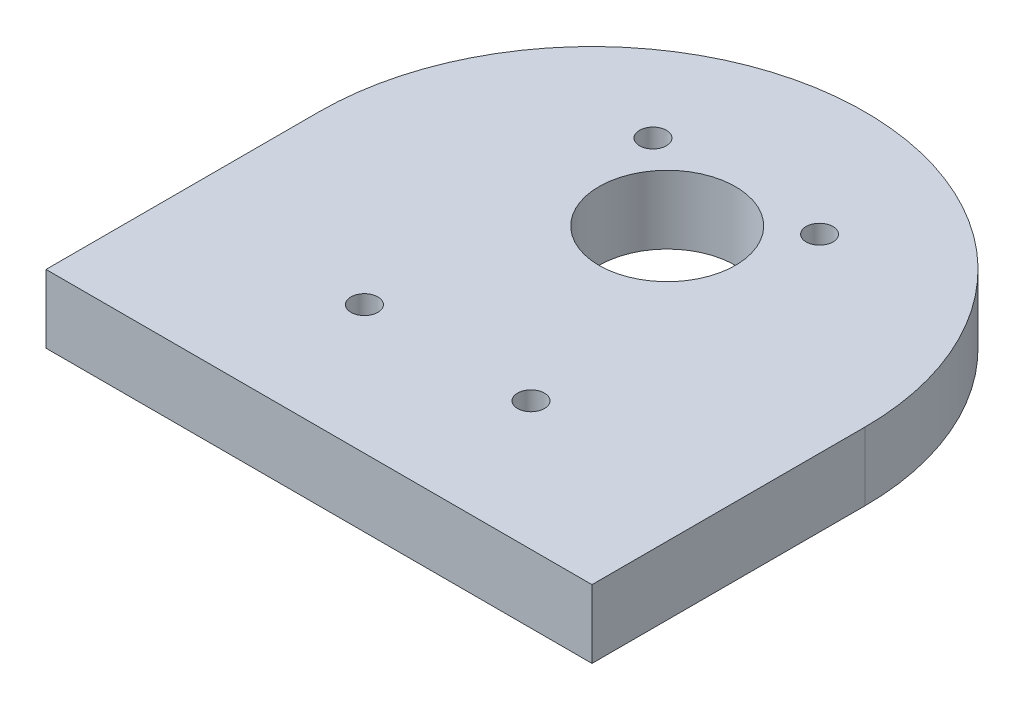
ISO-10303-21;
HEADER;
FILE_DESCRIPTION(('STEP AP214'),'2;1');
FILE_NAME('part.step','',(''),(''),'','','');
FILE_SCHEMA(('AUTOMOTIVE_DESIGN { 1 0 10303 214 1 1 1 1 }'));
ENDSEC;
DATA;
#1=APPLICATION_CONTEXT('core data for automotive mechanical design processes');
#2=APPLICATION_PROTOCOL_DEFINITION('international standard','automotive_design',2000,#1);
#3=PRODUCT_CONTEXT('',#1,'mechanical');
#4=PRODUCT('Part','Part','',(#3));
#5=PRODUCT_RELATED_PRODUCT_CATEGORY('part','',(#4));
#6=PRODUCT_DEFINITION_FORMATION('','',#4);
#7=PRODUCT_DEFINITION_CONTEXT('part definition',#1,'design');
#8=PRODUCT_DEFINITION('design','',#6,#7);
#9=PRODUCT_DEFINITION_SHAPE('','',#8);
#10=(LENGTH_UNIT() NAMED_UNIT(*) SI_UNIT(.MILLI.,.METRE.));
#11=(NAMED_UNIT(*) PLANE_ANGLE_UNIT() SI_UNIT($,.RADIAN.));
#12=(NAMED_UNIT(*) SI_UNIT($,.STERADIAN.) SOLID_ANGLE_UNIT());
#13=UNCERTAINTY_MEASURE_WITH_UNIT(LENGTH_MEASURE(1.E-05),#10,'distance_accuracy_value','');
#14=(GEOMETRIC_REPRESENTATION_CONTEXT(3) GLOBAL_UNCERTAINTY_ASSIGNED_CONTEXT((#13)) GLOBAL_UNIT_ASSIGNED_CONTEXT((#10,
#11,#12)) REPRESENTATION_CONTEXT('',''));
#15=CARTESIAN_POINT('',(0.,0.,0.));
#16=DIRECTION('',(0.,0.,1.));
#17=DIRECTION('',(1.,0.,0.));
#18=AXIS2_PLACEMENT_3D('',#15,#16,#17);
#19=CARTESIAN_POINT('',(0.,3.175,0.));
#20=DIRECTION('',(0.,1.,0.));
#21=DIRECTION('',(0.,0.,1.));
#22=AXIS2_PLACEMENT_3D('',#19,#20,#21);
#23=PLANE('',#22);
#24=CARTESIAN_POINT('',(-7.75000000000001,3.175,13.4233937586585));
#25=DIRECTION('',(0.,1.,0.));
#26=DIRECTION('',(0.,0.,1.));
#27=AXIS2_PLACEMENT_3D('',#24,#25,#26);
#28=CIRCLE('',#27,1.25000000000004);
#29=CARTESIAN_POINT('',(-7.75000000000001,3.175,14.6733937586586));
#30=VERTEX_POINT('',#29);
#31=EDGE_CURVE('E127',#30,#30,#28,.T.);
#32=ORIENTED_EDGE('',*,*,#31,.F.);
#33=EDGE_LOOP('',(#32));
#34=FACE_BOUND('',#33,.T.);
#35=CARTESIAN_POINT('',(7.74999999999983,3.175,-13.4233937586592));
#36=DIRECTION('',(0.,1.,0.));
#37=DIRECTION('',(0.,0.,1.));
#38=AXIS2_PLACEMENT_3D('',#35,#36,#37);
#39=CIRCLE('',#38,1.25000000000005);
#40=CARTESIAN_POINT('',(7.74999999999983,3.175,-12.1733937586591));
#41=VERTEX_POINT('',#40);
#42=EDGE_CURVE('E115',#41,#41,#39,.T.);
#43=ORIENTED_EDGE('',*,*,#42,.F.);
#44=EDGE_LOOP('',(#43));
#45=FACE_BOUND('',#44,.T.);
#46=CARTESIAN_POINT('',(0.,3.175,0.));
#47=DIRECTION('',(0.,1.,0.));
#48=DIRECTION('',(0.,0.,1.));
#49=AXIS2_PLACEMENT_3D('',#46,#47,#48);
#50=CIRCLE('',#49,25.4);
#51=CARTESIAN_POINT('',(25.4,3.175,0.));
#52=VERTEX_POINT('',#51);
#53=CARTESIAN_POINT('',(-25.4,3.175,0.));
#54=VERTEX_POINT('',#53);
#55=EDGE_CURVE('E84',#52,#54,#50,.T.);
#56=ORIENTED_EDGE('',*,*,#55,.T.);
#57=DIRECTION('',(0.,0.,1.));
#58=VECTOR('',#57,1.);
#59=CARTESIAN_POINT('',(-25.4,3.175,0.));
#60=LINE('',#59,#58);
#61=CARTESIAN_POINT('',(-25.4,3.175,25.4));
#62=VERTEX_POINT('',#61);
#63=EDGE_CURVE('E79',#54,#62,#60,.T.);
#64=ORIENTED_EDGE('',*,*,#63,.T.);
#65=DIRECTION('',(1.,0.,0.));
#66=VECTOR('',#65,1.);
#67=CARTESIAN_POINT('',(-25.4,3.175,25.4));
#68=LINE('',#67,#66);
#69=CARTESIAN_POINT('',(25.4,3.175,25.4));
#70=VERTEX_POINT('',#69);
#71=EDGE_CURVE('E82',#62,#70,#68,.T.);
#72=ORIENTED_EDGE('',*,*,#71,.T.);
#73=DIRECTION('',(0.,0.,-1.));
#74=VECTOR('',#73,1.);
#75=CARTESIAN_POINT('',(25.4,3.175,25.4));
#76=LINE('',#75,#74);
#77=EDGE_CURVE('E50',#70,#52,#76,.T.);
#78=ORIENTED_EDGE('',*,*,#77,.T.);
#79=EDGE_LOOP('',(#56,#64,#72,#78));
#80=FACE_BOUND('',#79,.T.);
#81=CARTESIAN_POINT('',(5.30904955390614E-10,3.175,-6.99999999992844));
#82=DIRECTION('',(0.,1.,0.));
#83=DIRECTION('',(0.,0.,1.));
#84=AXIS2_PLACEMENT_3D('',#81,#82,#83);
#85=CIRCLE('',#84,6.34999999957309);
#86=CARTESIAN_POINT('',(5.30904955390614E-10,3.175,-0.650000000355346));
#87=VERTEX_POINT('',#86);
#88=EDGE_CURVE('E100',#87,#87,#85,.T.);
#89=ORIENTED_EDGE('',*,*,#88,.F.);
#90=EDGE_LOOP('',(#89));
#91=FACE_BOUND('',#90,.T.);
#92=CARTESIAN_POINT('',(-7.7500000000002,3.175,-13.4233937586591));
#93=DIRECTION('',(0.,1.,0.));
#94=DIRECTION('',(0.,0.,1.));
#95=AXIS2_PLACEMENT_3D('',#92,#93,#94);
#96=CIRCLE('',#95,1.25000000000004);
#97=CARTESIAN_POINT('',(-7.7500000000002,3.175,-12.1733937586591));
#98=VERTEX_POINT('',#97);
#99=EDGE_CURVE('E121',#98,#98,#96,.T.);
#100=ORIENTED_EDGE('',*,*,#99,.F.);
#101=EDGE_LOOP('',(#100));
#102=FACE_BOUND('',#101,.T.);
#103=CARTESIAN_POINT('',(7.75000000000002,3.175,13.4233937586583));
#104=DIRECTION('',(0.,1.,0.));
#105=DIRECTION('',(0.,0.,1.));
#106=AXIS2_PLACEMENT_3D('',#103,#104,#105);
#107=CIRCLE('',#106,1.25000000000004);
#108=CARTESIAN_POINT('',(7.75000000000002,3.175,14.6733937586584));
#109=VERTEX_POINT('',#108);
#110=EDGE_CURVE('E133',#109,#109,#107,.T.);
#111=ORIENTED_EDGE('',*,*,#110,.F.);
#112=EDGE_LOOP('',(#111));
#113=FACE_BOUND('',#112,.T.);
#114=ADVANCED_FACE('F33',(#34,#45,#80,#91,#102,#113),#23,.T.);
#115=CARTESIAN_POINT('',(0.,-3.175,0.));
#116=DIRECTION('',(0.,1.,0.));
#117=DIRECTION('',(0.,0.,1.));
#118=AXIS2_PLACEMENT_3D('',#115,#116,#117);
#119=PLANE('',#118);
#120=CARTESIAN_POINT('',(0.,-3.175,0.));
#121=DIRECTION('',(0.,1.,0.));
#122=DIRECTION('',(0.,0.,1.));
#123=AXIS2_PLACEMENT_3D('',#120,#121,#122);
#124=CIRCLE('',#123,25.4);
#125=CARTESIAN_POINT('',(25.4,-3.175,0.));
#126=VERTEX_POINT('',#125);
#127=CARTESIAN_POINT('',(-25.4,-3.175,0.));
#128=VERTEX_POINT('',#127);
#129=EDGE_CURVE('E97',#126,#128,#124,.T.);
#130=ORIENTED_EDGE('',*,*,#129,.F.);
#131=DIRECTION('',(0.,0.,-1.));
#132=VECTOR('',#131,1.);
#133=CARTESIAN_POINT('',(25.4,-3.175,25.4));
#134=LINE('',#133,#132);
#135=CARTESIAN_POINT('',(25.4,-3.175,25.4));
#136=VERTEX_POINT('',#135);
#137=EDGE_CURVE('E72',#136,#126,#134,.T.);
#138=ORIENTED_EDGE('',*,*,#137,.F.);
#139=DIRECTION('',(1.,0.,0.));
#140=VECTOR('',#139,1.);
#141=CARTESIAN_POINT('',(0.,-3.175,25.4));
#142=LINE('',#141,#140);
#143=CARTESIAN_POINT('',(-25.4,-3.175,25.4));
#144=VERTEX_POINT('',#143);
#145=EDGE_CURVE('E66',#144,#136,#142,.T.);
#146=ORIENTED_EDGE('',*,*,#145,.F.);
#147=DIRECTION('',(0.,0.,1.));
#148=VECTOR('',#147,1.);
#149=CARTESIAN_POINT('',(-25.4,-3.175,0.));
#150=LINE('',#149,#148);
#151=EDGE_CURVE('E89',#128,#144,#150,.T.);
#152=ORIENTED_EDGE('',*,*,#151,.F.);
#153=EDGE_LOOP('',(#130,#138,#146,#152));
#154=FACE_BOUND('',#153,.T.);
#155=CARTESIAN_POINT('',(5.30904955390614E-10,-3.175,-6.99999999992844));
#156=DIRECTION('',(0.,1.,0.));
#157=DIRECTION('',(0.,0.,1.));
#158=AXIS2_PLACEMENT_3D('',#155,#156,#157);
#159=CIRCLE('',#158,6.34999999957309);
#160=CARTESIAN_POINT('',(5.30904955390614E-10,-3.175,-0.650000000355346));
#161=VERTEX_POINT('',#160);
#162=EDGE_CURVE('E112',#161,#161,#159,.T.);
#163=ORIENTED_EDGE('',*,*,#162,.T.);
#164=EDGE_LOOP('',(#163));
#165=FACE_BOUND('',#164,.T.);
#166=CARTESIAN_POINT('',(7.74999999999983,-3.175,-13.4233937586592));
#167=DIRECTION('',(0.,1.,0.));
#168=DIRECTION('',(0.,0.,1.));
#169=AXIS2_PLACEMENT_3D('',#166,#167,#168);
#170=CIRCLE('',#169,1.25000000000005);
#171=CARTESIAN_POINT('',(7.74999999999983,-3.175,-12.1733937586591));
#172=VERTEX_POINT('',#171);
#173=EDGE_CURVE('E118',#172,#172,#170,.T.);
#174=ORIENTED_EDGE('',*,*,#173,.T.);
#175=EDGE_LOOP('',(#174));
#176=FACE_BOUND('',#175,.T.);
#177=CARTESIAN_POINT('',(-7.7500000000002,-3.175,-13.4233937586591));
#178=DIRECTION('',(0.,1.,0.));
#179=DIRECTION('',(0.,0.,1.));
#180=AXIS2_PLACEMENT_3D('',#177,#178,#179);
#181=CIRCLE('',#180,1.25000000000004);
#182=CARTESIAN_POINT('',(-7.7500000000002,-3.175,-12.1733937586591));
#183=VERTEX_POINT('',#182);
#184=EDGE_CURVE('E124',#183,#183,#181,.T.);
#185=ORIENTED_EDGE('',*,*,#184,.T.);
#186=EDGE_LOOP('',(#185));
#187=FACE_BOUND('',#186,.T.);
#188=CARTESIAN_POINT('',(-7.75000000000001,-3.175,13.4233937586585));
#189=DIRECTION('',(0.,1.,0.));
#190=DIRECTION('',(0.,0.,1.));
#191=AXIS2_PLACEMENT_3D('',#188,#189,#190);
#192=CIRCLE('',#191,1.25000000000004);
#193=CARTESIAN_POINT('',(-7.75000000000001,-3.175,14.6733937586586));
#194=VERTEX_POINT('',#193);
#195=EDGE_CURVE('E130',#194,#194,#192,.T.);
#196=ORIENTED_EDGE('',*,*,#195,.T.);
#197=EDGE_LOOP('',(#196));
#198=FACE_BOUND('',#197,.T.);
#199=CARTESIAN_POINT('',(7.75000000000002,-3.175,13.4233937586583));
#200=DIRECTION('',(0.,1.,0.));
#201=DIRECTION('',(0.,0.,1.));
#202=AXIS2_PLACEMENT_3D('',#199,#200,#201);
#203=CIRCLE('',#202,1.25000000000004);
#204=CARTESIAN_POINT('',(7.75000000000002,-3.175,14.6733937586584));
#205=VERTEX_POINT('',#204);
#206=EDGE_CURVE('E136',#205,#205,#203,.T.);
#207=ORIENTED_EDGE('',*,*,#206,.T.);
#208=EDGE_LOOP('',(#207));
#209=FACE_BOUND('',#208,.T.);
#210=ADVANCED_FACE('F108',(#154,#165,#176,#187,#198,#209),#119,.F.);
#211=CARTESIAN_POINT('',(0.,3.175,0.));
#212=DIRECTION('',(0.,-1.,0.));
#213=DIRECTION('',(0.,0.,-1.));
#214=AXIS2_PLACEMENT_3D('',#211,#212,#213);
#215=CYLINDRICAL_SURFACE('',#214,25.4);
#216=ORIENTED_EDGE('',*,*,#129,.T.);
#217=DIRECTION('',(0.,-1.,0.));
#218=VECTOR('',#217,1.);
#219=CARTESIAN_POINT('',(-25.4,3.175,0.));
#220=LINE('',#219,#218);
#221=EDGE_CURVE('E11',#54,#128,#220,.T.);
#222=ORIENTED_EDGE('',*,*,#221,.F.);
#223=ORIENTED_EDGE('',*,*,#55,.F.);
#224=DIRECTION('',(0.,-1.,0.));
#225=VECTOR('',#224,1.);
#226=CARTESIAN_POINT('',(25.4,3.175,0.));
#227=LINE('',#226,#225);
#228=EDGE_CURVE('E93',#52,#126,#227,.T.);
#229=ORIENTED_EDGE('',*,*,#228,.T.);
#230=EDGE_LOOP('',(#216,#222,#223,#229));
#231=FACE_BOUND('',#230,.T.);
#232=ADVANCED_FACE('F35',(#231),#215,.T.);
#233=CARTESIAN_POINT('',(-25.4,3.175,0.));
#234=DIRECTION('',(1.,0.,0.));
#235=DIRECTION('',(0.,0.,-1.));
#236=AXIS2_PLACEMENT_3D('',#233,#234,#235);
#237=PLANE('',#236);
#238=ORIENTED_EDGE('',*,*,#151,.T.);
#239=DIRECTION('',(0.,-1.,0.));
#240=VECTOR('',#239,1.);
#241=CARTESIAN_POINT('',(-25.4,3.175,25.4));
#242=LINE('',#241,#240);
#243=EDGE_CURVE('E42',#62,#144,#242,.T.);
#244=ORIENTED_EDGE('',*,*,#243,.F.);
#245=ORIENTED_EDGE('',*,*,#63,.F.);
#246=ORIENTED_EDGE('',*,*,#221,.T.);
#247=EDGE_LOOP('',(#238,#244,#245,#246));
#248=FACE_BOUND('',#247,.T.);
#249=ADVANCED_FACE('F88',(#248),#237,.F.);
#250=CARTESIAN_POINT('',(0.,3.175,25.4));
#251=DIRECTION('',(0.,0.,-1.));
#252=DIRECTION('',(-1.,0.,0.));
#253=AXIS2_PLACEMENT_3D('',#250,#251,#252);
#254=PLANE('',#253);
#255=ORIENTED_EDGE('',*,*,#145,.T.);
#256=DIRECTION('',(0.,-1.,0.));
#257=VECTOR('',#256,1.);
#258=CARTESIAN_POINT('',(25.4,3.175,25.4));
#259=LINE('',#258,#257);
#260=EDGE_CURVE('E90',#70,#136,#259,.T.);
#261=ORIENTED_EDGE('',*,*,#260,.F.);
#262=ORIENTED_EDGE('',*,*,#71,.F.);
#263=ORIENTED_EDGE('',*,*,#243,.T.);
#264=EDGE_LOOP('',(#255,#261,#262,#263));
#265=FACE_BOUND('',#264,.T.);
#266=ADVANCED_FACE('F91',(#265),#254,.F.);
#267=CARTESIAN_POINT('',(25.4,3.175,25.4));
#268=DIRECTION('',(-1.,0.,0.));
#269=DIRECTION('',(0.,0.,1.));
#270=AXIS2_PLACEMENT_3D('',#267,#268,#269);
#271=PLANE('',#270);
#272=ORIENTED_EDGE('',*,*,#137,.T.);
#273=ORIENTED_EDGE('',*,*,#228,.F.);
#274=ORIENTED_EDGE('',*,*,#77,.F.);
#275=ORIENTED_EDGE('',*,*,#260,.T.);
#276=EDGE_LOOP('',(#272,#273,#274,#275));
#277=FACE_BOUND('',#276,.T.);
#278=ADVANCED_FACE('F105',(#277),#271,.F.);
#279=CARTESIAN_POINT('',(5.30904955390614E-10,3.175,-6.99999999992844));
#280=DIRECTION('',(0.,-1.,0.));
#281=DIRECTION('',(0.,0.,-1.));
#282=AXIS2_PLACEMENT_3D('',#279,#280,#281);
#283=CYLINDRICAL_SURFACE('',#282,6.34999999957309);
#284=ORIENTED_EDGE('',*,*,#88,.T.);
#285=EDGE_LOOP('',(#284));
#286=FACE_BOUND('',#285,.T.);
#287=ORIENTED_EDGE('',*,*,#162,.F.);
#288=EDGE_LOOP('',(#287));
#289=FACE_BOUND('',#288,.T.);
#290=ADVANCED_FACE('F155',(#286,#289),#283,.F.);
#291=CARTESIAN_POINT('',(7.74999999999983,3.175,-13.4233937586592));
#292=DIRECTION('',(0.,-1.,0.));
#293=DIRECTION('',(0.,0.,-1.));
#294=AXIS2_PLACEMENT_3D('',#291,#292,#293);
#295=CYLINDRICAL_SURFACE('',#294,1.25000000000005);
#296=ORIENTED_EDGE('',*,*,#42,.T.);
#297=EDGE_LOOP('',(#296));
#298=FACE_BOUND('',#297,.T.);
#299=ORIENTED_EDGE('',*,*,#173,.F.);
#300=EDGE_LOOP('',(#299));
#301=FACE_BOUND('',#300,.T.);
#302=ADVANCED_FACE('F204',(#298,#301),#295,.F.);
#303=CARTESIAN_POINT('',(-7.7500000000002,3.175,-13.4233937586591));
#304=DIRECTION('',(0.,-1.,0.));
#305=DIRECTION('',(0.,0.,-1.));
#306=AXIS2_PLACEMENT_3D('',#303,#304,#305);
#307=CYLINDRICAL_SURFACE('',#306,1.25000000000004);
#308=ORIENTED_EDGE('',*,*,#99,.T.);
#309=EDGE_LOOP('',(#308));
#310=FACE_BOUND('',#309,.T.);
#311=ORIENTED_EDGE('',*,*,#184,.F.);
#312=EDGE_LOOP('',(#311));
#313=FACE_BOUND('',#312,.T.);
#314=ADVANCED_FACE('F212',(#310,#313),#307,.F.);
#315=CARTESIAN_POINT('',(-7.75000000000001,3.175,13.4233937586585));
#316=DIRECTION('',(0.,-1.,0.));
#317=DIRECTION('',(0.,0.,-1.));
#318=AXIS2_PLACEMENT_3D('',#315,#316,#317);
#319=CYLINDRICAL_SURFACE('',#318,1.25000000000004);
#320=ORIENTED_EDGE('',*,*,#31,.T.);
#321=EDGE_LOOP('',(#320));
#322=FACE_BOUND('',#321,.T.);
#323=ORIENTED_EDGE('',*,*,#195,.F.);
#324=EDGE_LOOP('',(#323));
#325=FACE_BOUND('',#324,.T.);
#326=ADVANCED_FACE('F220',(#322,#325),#319,.F.);
#327=CARTESIAN_POINT('',(7.75000000000002,3.175,13.4233937586583));
#328=DIRECTION('',(0.,-1.,0.));
#329=DIRECTION('',(0.,0.,-1.));
#330=AXIS2_PLACEMENT_3D('',#327,#328,#329);
#331=CYLINDRICAL_SURFACE('',#330,1.25000000000004);
#332=ORIENTED_EDGE('',*,*,#110,.T.);
#333=EDGE_LOOP('',(#332));
#334=FACE_BOUND('',#333,.T.);
#335=ORIENTED_EDGE('',*,*,#206,.F.);
#336=EDGE_LOOP('',(#335));
#337=FACE_BOUND('',#336,.T.);
#338=ADVANCED_FACE('F142',(#334,#337),#331,.F.);
#339=CLOSED_SHELL('',(#114,#210,#232,#249,#266,#278,#290,#302,#314,#326,#338));
#340=MANIFOLD_SOLID_BREP('B2',#339);
#341=ADVANCED_BREP_SHAPE_REPRESENTATION('',(#18,#340),#14);
#342=SHAPE_DEFINITION_REPRESENTATION(#9,#341);
ENDSEC;
END-ISO-10303-21;
